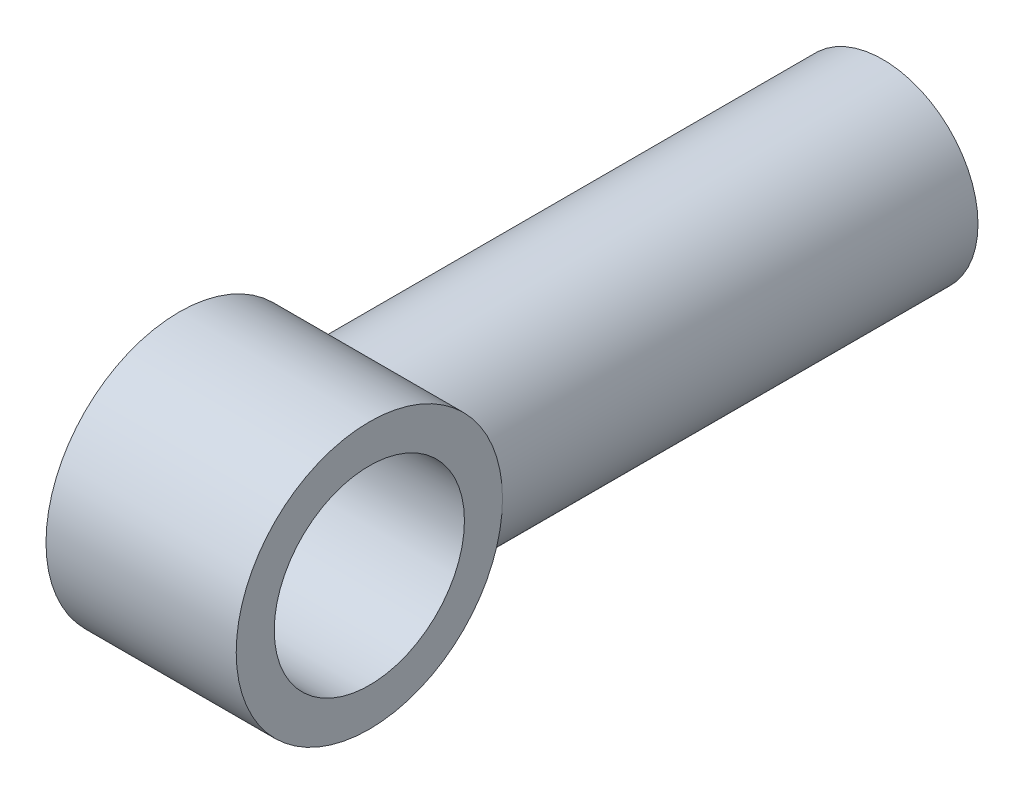
ISO-10303-21;
HEADER;
FILE_DESCRIPTION(('STEP AP214'),'2;1');
FILE_NAME('part.step','',(''),(''),'','','');
FILE_SCHEMA(('AUTOMOTIVE_DESIGN { 1 0 10303 214 1 1 1 1 }'));
ENDSEC;
DATA;
#1=APPLICATION_CONTEXT('core data for automotive mechanical design processes');
#2=APPLICATION_PROTOCOL_DEFINITION('international standard','automotive_design',2000,#1);
#3=PRODUCT_CONTEXT('',#1,'mechanical');
#4=PRODUCT('Part','Part','',(#3));
#5=PRODUCT_RELATED_PRODUCT_CATEGORY('part','',(#4));
#6=PRODUCT_DEFINITION_FORMATION('','',#4);
#7=PRODUCT_DEFINITION_CONTEXT('part definition',#1,'design');
#8=PRODUCT_DEFINITION('design','',#6,#7);
#9=PRODUCT_DEFINITION_SHAPE('','',#8);
#10=(LENGTH_UNIT() NAMED_UNIT(*) SI_UNIT(.MILLI.,.METRE.));
#11=(NAMED_UNIT(*) PLANE_ANGLE_UNIT() SI_UNIT($,.RADIAN.));
#12=(NAMED_UNIT(*) SI_UNIT($,.STERADIAN.) SOLID_ANGLE_UNIT());
#13=UNCERTAINTY_MEASURE_WITH_UNIT(LENGTH_MEASURE(1.E-05),#10,'distance_accuracy_value','');
#14=(GEOMETRIC_REPRESENTATION_CONTEXT(3) GLOBAL_UNCERTAINTY_ASSIGNED_CONTEXT((#13)) GLOBAL_UNIT_ASSIGNED_CONTEXT((#10,
#11,#12)) REPRESENTATION_CONTEXT('',''));
#15=CARTESIAN_POINT('',(0.,0.,0.));
#16=DIRECTION('',(0.,0.,1.));
#17=DIRECTION('',(1.,0.,0.));
#18=AXIS2_PLACEMENT_3D('',#15,#16,#17);
#19=CARTESIAN_POINT('',(3.175,0.,0.));
#20=DIRECTION('',(-1.,0.,0.));
#21=DIRECTION('',(0.,0.,1.));
#22=AXIS2_PLACEMENT_3D('',#19,#20,#21);
#23=CYLINDRICAL_SURFACE('',#22,4.445);
#24=CARTESIAN_POINT('',(3.17499999999998,0.,-4.445));
#25=CARTESIAN_POINT('',(3.17500045964919,-0.157135345690454,-4.44500068146169));
#26=CARTESIAN_POINT('',(3.16326784936826,-0.314264695933462,-4.43659739655863));
#27=CARTESIAN_POINT('',(3.11711518775272,-0.623439378001871,-4.40381046159461));
#28=CARTESIAN_POINT('',(3.08268526513322,-0.775482467517806,-4.37941985851772));
#29=CARTESIAN_POINT('',(2.99337447106168,-1.06951031993426,-4.31702204892824));
#30=CARTESIAN_POINT('',(2.93859592046098,-1.21154124689257,-4.27908300555363));
#31=CARTESIAN_POINT('',(2.81104767490878,-1.48365791708574,-4.19251669423569));
#32=CARTESIAN_POINT('',(2.7382755699989,-1.61374205702991,-4.14388799467509));
#33=CARTESIAN_POINT('',(2.56983185931845,-1.87146569941416,-4.03447201061871));
#34=CARTESIAN_POINT('',(2.47269228627367,-1.99784078549901,-3.97298557684852));
#35=CARTESIAN_POINT('',(2.2619493513509,-2.23366824543392,-3.8453538470804));
#36=CARTESIAN_POINT('',(2.14832133183854,-2.34309475772077,-3.77920165119487));
#37=CARTESIAN_POINT('',(1.95558944919742,-2.50299051017439,-3.67398192732405));
#38=CARTESIAN_POINT('',(1.88129258997702,-2.55931026254697,-3.63486559549201));
#39=CARTESIAN_POINT('',(1.72763964967273,-2.6654488798687,-3.55776896432843));
#40=CARTESIAN_POINT('',(1.6482821979517,-2.71526597237644,-3.51978897689761));
#41=CARTESIAN_POINT('',(1.40297683284193,-2.85439036336254,-3.40945492571689));
#42=CARTESIAN_POINT('',(1.22942424071437,-2.93368114625014,-3.34049226541055));
#43=CARTESIAN_POINT('',(0.923196947054475,-3.0406456811152,-3.24283714301298));
#44=CARTESIAN_POINT('',(0.795290150967088,-3.07671836514147,-3.20832430819869));
#45=CARTESIAN_POINT('',(0.533126960181833,-3.13277503431814,-3.15361656217548));
#46=CARTESIAN_POINT('',(0.398884677128958,-3.15279314022328,-3.13339129660048));
#47=CARTESIAN_POINT('',(0.126492369779067,-3.17543562714864,-3.11045536719717));
#48=CARTESIAN_POINT('',(-0.0116772694001373,-3.17794702829424,-3.10785847122045));
#49=CARTESIAN_POINT('',(-0.286340154836318,-3.1650558625028,-3.12097884331295));
#50=CARTESIAN_POINT('',(-0.422831922198554,-3.14963849762627,-3.13671123992595));
#51=CARTESIAN_POINT('',(-0.707068292395042,-3.09905197005017,-3.18673530405887));
#52=CARTESIAN_POINT('',(-0.854019399674728,-3.0616087927839,-3.22314331149823));
#53=CARTESIAN_POINT('',(-1.13761676864169,-2.96797542374644,-3.30956011648952));
#54=CARTESIAN_POINT('',(-1.27423936363188,-2.91174368672785,-3.35959900894292));
#55=CARTESIAN_POINT('',(-1.57667078474811,-2.7624841869375,-3.48407583860094));
#56=CARTESIAN_POINT('',(-1.7384022671493,-2.66345367809461,-3.56126926169923));
#57=CARTESIAN_POINT('',(-1.96523737543923,-2.49546071466058,-3.67905325509913));
#58=CARTESIAN_POINT('',(-2.03828078992712,-2.43615958901142,-3.71868353270507));
#59=CARTESIAN_POINT('',(-2.17893153290881,-2.31122076495171,-3.79759744769026));
#60=CARTESIAN_POINT('',(-2.24653860175233,-2.24558276420896,-3.83688106843285));
#61=CARTESIAN_POINT('',(-2.44205554328341,-2.03796614624733,-3.95347588392179));
#62=CARTESIAN_POINT('',(-2.56129588999667,-1.88629127758158,-4.02879132801684));
#63=CARTESIAN_POINT('',(-2.71937263675317,-1.64166414024874,-4.1316855757333));
#64=CARTESIAN_POINT('',(-2.76858315147266,-1.55731179684567,-4.16429122014675));
#65=CARTESIAN_POINT('',(-2.85953038891172,-1.38323882824111,-4.22530126269537));
#66=CARTESIAN_POINT('',(-2.90126992295567,-1.29352023938135,-4.25370724045877));
#67=CARTESIAN_POINT('',(-2.99496111029027,-1.06429426739449,-4.31804606138638));
#68=CARTESIAN_POINT('',(-3.04197620477585,-0.921831227979809,-4.35090049906725));
#69=CARTESIAN_POINT('',(-3.11564326881559,-0.6293690965414,-4.40272032805322));
#70=CARTESIAN_POINT('',(-3.14231003582932,-0.47937556551234,-4.42169581182264));
#71=CARTESIAN_POINT('',(-3.17383772437397,-0.175435542142042,-4.44415567043381));
#72=CARTESIAN_POINT('',(-3.17862947055822,-0.0214780558641051,-4.44759090204886));
#73=CARTESIAN_POINT('',(-3.16589865790746,0.285036073303244,-4.43850144348559));
#74=CARTESIAN_POINT('',(-3.14837372862276,0.437592565647085,-4.42597505788392));
#75=CARTESIAN_POINT('',(-3.09345367061143,0.729515179991223,-4.38708387069533));
#76=CARTESIAN_POINT('',(-3.05704484788875,0.869163458922513,-4.36140670188928));
#77=CARTESIAN_POINT('',(-2.96675118835914,1.13991128382523,-4.29860015071631));
#78=CARTESIAN_POINT('',(-2.91286280734965,1.27100908959924,-4.26146844587147));
#79=CARTESIAN_POINT('',(-2.78402428543244,1.53401164556839,-4.17441350177182));
#80=CARTESIAN_POINT('',(-2.70760560881418,1.66490795868587,-4.12363470440702));
#81=CARTESIAN_POINT('',(-2.53874190708081,1.91256849724282,-4.01477805597365));
#82=CARTESIAN_POINT('',(-2.44628445692201,2.02932164616568,-3.95669455570624));
#83=CARTESIAN_POINT('',(-2.22914522080758,2.2676051863268,-3.82591561039413));
#84=CARTESIAN_POINT('',(-2.10165982238922,2.38617549546956,-3.75247824490861));
#85=CARTESIAN_POINT('',(-1.82862844716676,2.60134233804902,-3.6066498178493));
#86=CARTESIAN_POINT('',(-1.68307290092945,2.69792715122377,-3.53425933352353));
#87=CARTESIAN_POINT('',(-1.39879971856191,2.8541272161865,-3.40887194703443));
#88=CARTESIAN_POINT('',(-1.26252459619772,2.91715329199723,-3.3546086535031));
#89=CARTESIAN_POINT('',(-0.978660985741491,3.02419231184678,-3.25844754716593));
#90=CARTESIAN_POINT('',(-0.83109721914056,3.06824547698383,-3.21652363620148));
#91=CARTESIAN_POINT('',(-0.555393678523282,3.12860760979771,-3.15773522667382));
#92=CARTESIAN_POINT('',(-0.42875531542085,3.1485558607941,-3.13765763912142));
#93=CARTESIAN_POINT('',(-0.172546801665676,3.1729104135385,-3.11303544928366));
#94=CARTESIAN_POINT('',(-0.0429800817410187,3.17733404070829,-3.10847353174467));
#95=CARTESIAN_POINT('',(0.215254554741081,3.17032863993121,-3.11561503539182));
#96=CARTESIAN_POINT('',(0.343922409846359,3.15889853857781,-3.127319557928));
#97=CARTESIAN_POINT('',(0.596917917334661,3.12101544445271,-3.16511878357131));
#98=CARTESIAN_POINT('',(0.721238538740617,3.09453921093339,-3.19123574679514));
#99=CARTESIAN_POINT('',(1.0041976405938,3.01669516022413,-3.26516715147605));
#100=CARTESIAN_POINT('',(1.16019174059299,2.95993301109254,-3.3173349374837));
#101=CARTESIAN_POINT('',(1.4581546626424,2.82511343871106,-3.4328752462651));
#102=CARTESIAN_POINT('',(1.60009963165899,2.74702061679844,-3.49626633224899));
#103=CARTESIAN_POINT('',(1.87281477305587,2.56912306918348,-3.62909163627679));
#104=CARTESIAN_POINT('',(2.00318164587607,2.46879081622876,-3.69864254201248));
#105=CARTESIAN_POINT('',(2.24740696980876,2.24872933764268,-3.83641575839731));
#106=CARTESIAN_POINT('',(2.36125972278529,2.12899344688695,-3.90463760346325));
#107=CARTESIAN_POINT('',(2.52706766289521,1.92458168073321,-4.00764148399395));
#108=CARTESIAN_POINT('',(2.58514727918591,1.84588796987316,-4.04458372400266));
#109=CARTESIAN_POINT('',(2.69435339557554,1.68247888032707,-4.11524025567883));
#110=CARTESIAN_POINT('',(2.74548321545109,1.59776640633826,-4.14895608624232));
#111=CARTESIAN_POINT('',(2.84010416307998,1.4227821674067,-4.2121674246624));
#112=CARTESIAN_POINT('',(2.88360287598244,1.33251604463305,-4.2416671177961));
#113=CARTESIAN_POINT('',(2.96228341125025,1.14702292614422,-4.29554475029446));
#114=CARTESIAN_POINT('',(2.99746845970105,1.05179787228693,-4.31992467595527));
#115=CARTESIAN_POINT('',(3.07603025279277,0.802476586002146,-4.37471835079486));
#116=CARTESIAN_POINT('',(3.1129478339349,0.645294183223843,-4.40085699047611));
#117=CARTESIAN_POINT('',(3.16242059567295,0.325402014020016,-4.43598910603987));
#118=CARTESIAN_POINT('',(3.17499952407961,0.162697793296492,-4.44499929441519));
#119=CARTESIAN_POINT('',(3.17499999999998,0.,-4.445));
#120=B_SPLINE_CURVE_WITH_KNOTS('',3,(#24,#25,#26,#27,#28,#29,#30,#31,#32,#33,#34,#35,#36,#37,
#38,#39,#40,#41,#42,#43,#44,#45,#46,#47,#48,#49,#50,#51,#52,#53,#54,#55,#56,#57,#58,#59,#60,#61,
#62,#63,#64,#65,#66,#67,#68,#69,#70,#71,#72,#73,#74,#75,#76,#77,#78,#79,#80,#81,#82,#83,#84,#85,
#86,#87,#88,#89,#90,#91,#92,#93,#94,#95,#96,#97,#98,#99,#100,#101,#102,#103,#104,#105,#106,#107,
#108,#109,#110,#111,#112,#113,#114,#115,#116,#117,#118,#119),.UNSPECIFIED.,.T.,.F.,(4,2,2,2,2,2,
2,2,2,2,2,2,2,2,2,2,2,2,2,2,2,2,2,2,2,2,2,2,2,2,2,2,2,2,2,2,2,2,2,2,2,2,2,2,2,2,2,4),(0.,
0.470761773387411,0.941728420901217,1.41035823318545,1.87905084521829,2.38975724688184,
2.90123540900895,3.2042249900184,3.50729698573711,4.11187024161111,4.52231828310969,
4.93189167144032,5.3441058230714,5.75666044722062,6.22197984742601,6.68833504678566,
7.29922376132405,7.60522045092208,7.91123174683798,8.52874256985675,8.8372157972748,
9.14557270129032,9.60420610232046,10.0625056629378,10.5222535042108,10.9820501834052,
11.4199439492373,11.8579265591553,12.3356942377202,12.8138337036218,13.3785140282358,
13.9434946773142,14.420823415074,14.8971352116425,15.2847301731364,15.6718924423201,
16.0590809263333,16.4468691062568,16.9660482627593,17.4860942973884,18.0201291482468,
18.5543478297358,18.8676105626928,19.1807231265412,19.493522678085,19.8062006488912,
20.2941032576449,20.7815295675049),.UNSPECIFIED.);
#121=CARTESIAN_POINT('',(3.17499999999998,0.,-4.445));
#122=VERTEX_POINT('',#121);
#123=CARTESIAN_POINT('',(-3.175,0.,-4.445));
#124=VERTEX_POINT('',#123);
#125=EDGE_CURVE('E11',#122,#124,#120,.T.);
#126=ORIENTED_EDGE('',*,*,#125,.F.);
#127=CARTESIAN_POINT('',(3.175,0.,0.));
#128=DIRECTION('',(1.,0.,0.));
#129=DIRECTION('',(0.,0.,-1.));
#130=AXIS2_PLACEMENT_3D('',#127,#128,#129);
#131=CIRCLE('',#130,4.445);
#132=EDGE_CURVE('E52',#122,#122,#131,.T.);
#133=ORIENTED_EDGE('',*,*,#132,.F.);
#134=EDGE_CURVE('E38',#124,#122,#120,.T.);
#135=ORIENTED_EDGE('',*,*,#134,.F.);
#136=CARTESIAN_POINT('',(-3.175,0.,0.));
#137=DIRECTION('',(1.,0.,0.));
#138=DIRECTION('',(0.,0.,-1.));
#139=AXIS2_PLACEMENT_3D('',#136,#137,#138);
#140=CIRCLE('',#139,4.445);
#141=EDGE_CURVE('E56',#124,#124,#140,.T.);
#142=ORIENTED_EDGE('',*,*,#141,.T.);
#143=EDGE_LOOP('',(#126,#133,#135,#142));
#144=FACE_BOUND('',#143,.T.);
#145=ADVANCED_FACE('F33',(#144),#23,.T.);
#146=CARTESIAN_POINT('',(3.175,0.,0.));
#147=DIRECTION('',(1.,0.,0.));
#148=DIRECTION('',(0.,0.,-1.));
#149=AXIS2_PLACEMENT_3D('',#146,#147,#148);
#150=PLANE('',#149);
#151=CARTESIAN_POINT('',(3.175,0.,0.));
#152=DIRECTION('',(1.,0.,0.));
#153=DIRECTION('',(0.,0.,-1.));
#154=AXIS2_PLACEMENT_3D('',#151,#152,#153);
#155=CIRCLE('',#154,3.175);
#156=CARTESIAN_POINT('',(3.175,0.,-3.175));
#157=VERTEX_POINT('',#156);
#158=EDGE_CURVE('E66',#157,#157,#155,.T.);
#159=ORIENTED_EDGE('',*,*,#158,.F.);
#160=EDGE_LOOP('',(#159));
#161=FACE_BOUND('',#160,.T.);
#162=ORIENTED_EDGE('',*,*,#132,.T.);
#163=EDGE_LOOP('',(#162));
#164=FACE_BOUND('',#163,.T.);
#165=ADVANCED_FACE('F82',(#161,#164),#150,.T.);
#166=CARTESIAN_POINT('',(-3.175,0.,0.));
#167=DIRECTION('',(1.,0.,0.));
#168=DIRECTION('',(0.,0.,-1.));
#169=AXIS2_PLACEMENT_3D('',#166,#167,#168);
#170=PLANE('',#169);
#171=CARTESIAN_POINT('',(-3.175,0.,0.));
#172=DIRECTION('',(1.,0.,0.));
#173=DIRECTION('',(0.,0.,-1.));
#174=AXIS2_PLACEMENT_3D('',#171,#172,#173);
#175=CIRCLE('',#174,3.175);
#176=CARTESIAN_POINT('',(-3.175,0.,-3.175));
#177=VERTEX_POINT('',#176);
#178=EDGE_CURVE('E64',#177,#177,#175,.T.);
#179=ORIENTED_EDGE('',*,*,#178,.T.);
#180=EDGE_LOOP('',(#179));
#181=FACE_BOUND('',#180,.T.);
#182=ORIENTED_EDGE('',*,*,#141,.F.);
#183=EDGE_LOOP('',(#182));
#184=FACE_BOUND('',#183,.T.);
#185=ADVANCED_FACE('F72',(#181,#184),#170,.F.);
#186=CARTESIAN_POINT('',(0.,0.,-20.32));
#187=DIRECTION('',(0.,0.,1.));
#188=DIRECTION('',(1.,0.,0.));
#189=AXIS2_PLACEMENT_3D('',#186,#187,#188);
#190=CYLINDRICAL_SURFACE('',#189,3.17499999999998);
#191=CARTESIAN_POINT('',(0.,0.,-20.32));
#192=DIRECTION('',(0.,0.,1.));
#193=DIRECTION('',(1.,0.,0.));
#194=AXIS2_PLACEMENT_3D('',#191,#192,#193);
#195=CIRCLE('',#194,3.17499999999998);
#196=CARTESIAN_POINT('',(3.17499999999998,0.,-20.32));
#197=VERTEX_POINT('',#196);
#198=EDGE_CURVE('E58',#197,#197,#195,.T.);
#199=ORIENTED_EDGE('',*,*,#198,.T.);
#200=EDGE_LOOP('',(#199));
#201=FACE_BOUND('',#200,.T.);
#202=ORIENTED_EDGE('',*,*,#134,.T.);
#203=ORIENTED_EDGE('',*,*,#125,.T.);
#204=EDGE_LOOP('',(#202,#203));
#205=FACE_BOUND('',#204,.T.);
#206=ADVANCED_FACE('F35',(#201,#205),#190,.T.);
#207=CARTESIAN_POINT('',(0.,0.,-20.32));
#208=DIRECTION('',(0.,0.,1.));
#209=DIRECTION('',(1.,0.,0.));
#210=AXIS2_PLACEMENT_3D('',#207,#208,#209);
#211=PLANE('',#210);
#212=ORIENTED_EDGE('',*,*,#198,.F.);
#213=EDGE_LOOP('',(#212));
#214=FACE_BOUND('',#213,.T.);
#215=ADVANCED_FACE('F78',(#214),#211,.F.);
#216=CARTESIAN_POINT('',(-3.175,0.,0.));
#217=DIRECTION('',(1.,0.,0.));
#218=DIRECTION('',(0.,0.,-1.));
#219=AXIS2_PLACEMENT_3D('',#216,#217,#218);
#220=CYLINDRICAL_SURFACE('',#219,3.175);
#221=ORIENTED_EDGE('',*,*,#178,.F.);
#222=EDGE_LOOP('',(#221));
#223=FACE_BOUND('',#222,.T.);
#224=ORIENTED_EDGE('',*,*,#158,.T.);
#225=EDGE_LOOP('',(#224));
#226=FACE_BOUND('',#225,.T.);
#227=ADVANCED_FACE('F75',(#223,#226),#220,.F.);
#228=CLOSED_SHELL('',(#145,#165,#185,#206,#215,#227));
#229=MANIFOLD_SOLID_BREP('B2',#228);
#230=ADVANCED_BREP_SHAPE_REPRESENTATION('',(#18,#229),#14);
#231=SHAPE_DEFINITION_REPRESENTATION(#9,#230);
ENDSEC;
END-ISO-10303-21;
